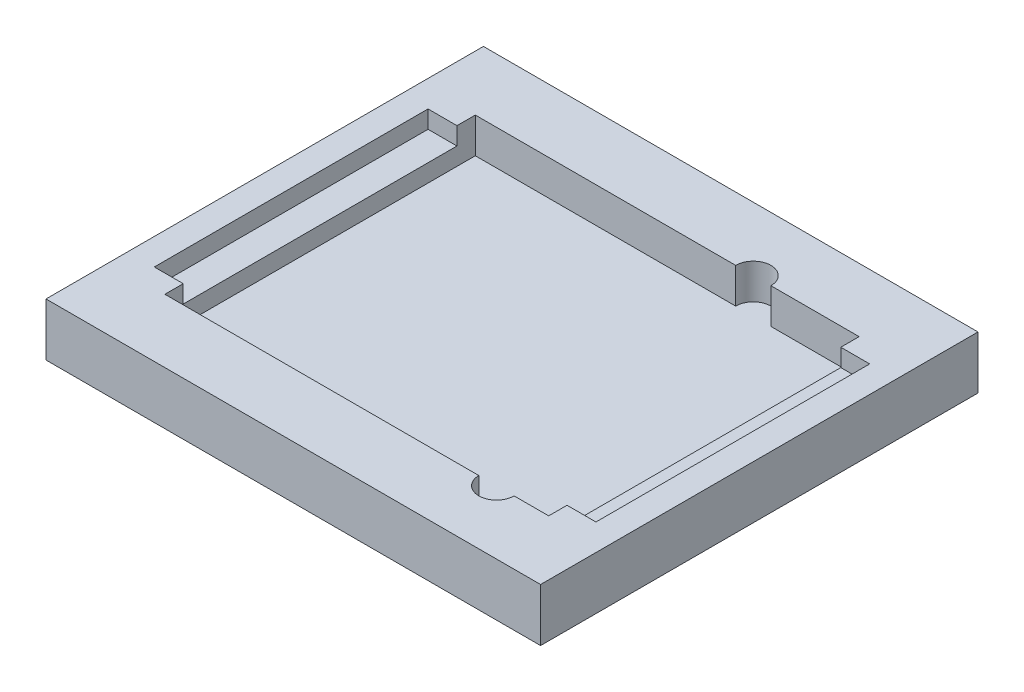
ISO-10303-21;
HEADER;
FILE_DESCRIPTION(('STEP AP214'),'2;1');
FILE_NAME('part.step','',(''),(''),'','','');
FILE_SCHEMA(('AUTOMOTIVE_DESIGN { 1 0 10303 214 1 1 1 1 }'));
ENDSEC;
DATA;
#1=APPLICATION_CONTEXT('core data for automotive mechanical design processes');
#2=APPLICATION_PROTOCOL_DEFINITION('international standard','automotive_design',2000,#1);
#3=PRODUCT_CONTEXT('',#1,'mechanical');
#4=PRODUCT('Part','Part','',(#3));
#5=PRODUCT_RELATED_PRODUCT_CATEGORY('part','',(#4));
#6=PRODUCT_DEFINITION_FORMATION('','',#4);
#7=PRODUCT_DEFINITION_CONTEXT('part definition',#1,'design');
#8=PRODUCT_DEFINITION('design','',#6,#7);
#9=PRODUCT_DEFINITION_SHAPE('','',#8);
#10=(LENGTH_UNIT() NAMED_UNIT(*) SI_UNIT(.MILLI.,.METRE.));
#11=(NAMED_UNIT(*) PLANE_ANGLE_UNIT() SI_UNIT($,.RADIAN.));
#12=(NAMED_UNIT(*) SI_UNIT($,.STERADIAN.) SOLID_ANGLE_UNIT());
#13=UNCERTAINTY_MEASURE_WITH_UNIT(LENGTH_MEASURE(1.E-05),#10,'distance_accuracy_value','');
#14=(GEOMETRIC_REPRESENTATION_CONTEXT(3) GLOBAL_UNCERTAINTY_ASSIGNED_CONTEXT((#13)) GLOBAL_UNIT_ASSIGNED_CONTEXT((#10,
#11,#12)) REPRESENTATION_CONTEXT('',''));
#15=CARTESIAN_POINT('',(0.,0.,0.));
#16=DIRECTION('',(0.,0.,1.));
#17=DIRECTION('',(1.,0.,0.));
#18=AXIS2_PLACEMENT_3D('',#15,#16,#17);
#19=CARTESIAN_POINT('',(2.54,3.175,-2.54));
#20=DIRECTION('',(0.,-1.,0.));
#21=DIRECTION('',(0.,0.,-1.));
#22=AXIS2_PLACEMENT_3D('',#19,#20,#21);
#23=CYLINDRICAL_SURFACE('',#22,2.54);
#24=CARTESIAN_POINT('',(2.54,0.,-2.54));
#25=DIRECTION('',(0.,1.,0.));
#26=DIRECTION('',(0.,0.,-1.));
#27=AXIS2_PLACEMENT_3D('',#24,#25,#26);
#28=CIRCLE('',#27,2.54);
#29=CARTESIAN_POINT('',(0.,0.,-2.54000000000002));
#30=VERTEX_POINT('',#29);
#31=CARTESIAN_POINT('',(2.54000000000002,0.,0.));
#32=VERTEX_POINT('',#31);
#33=EDGE_CURVE('E381',#30,#32,#28,.T.);
#34=ORIENTED_EDGE('',*,*,#33,.T.);
#35=DIRECTION('',(0.,-1.,0.));
#36=VECTOR('',#35,1.);
#37=CARTESIAN_POINT('',(2.54000000000002,3.175,0.));
#38=LINE('',#37,#36);
#39=CARTESIAN_POINT('',(2.54000000000002,3.175,0.));
#40=VERTEX_POINT('',#39);
#41=EDGE_CURVE('E11',#40,#32,#38,.T.);
#42=ORIENTED_EDGE('',*,*,#41,.F.);
#43=CARTESIAN_POINT('',(2.54,3.175,-2.54));
#44=DIRECTION('',(0.,1.,0.));
#45=DIRECTION('',(0.,0.,-1.));
#46=AXIS2_PLACEMENT_3D('',#43,#44,#45);
#47=CIRCLE('',#46,2.54);
#48=CARTESIAN_POINT('',(0.,3.175,-2.54000000000002));
#49=VERTEX_POINT('',#48);
#50=EDGE_CURVE('E382',#49,#40,#47,.T.);
#51=ORIENTED_EDGE('',*,*,#50,.F.);
#52=DIRECTION('',(0.,-1.,0.));
#53=VECTOR('',#52,1.);
#54=CARTESIAN_POINT('',(0.,3.175,-2.54000000000002));
#55=LINE('',#54,#53);
#56=EDGE_CURVE('E407',#49,#30,#55,.T.);
#57=ORIENTED_EDGE('',*,*,#56,.T.);
#58=EDGE_LOOP('',(#34,#42,#51,#57));
#59=FACE_BOUND('',#58,.T.);
#60=ADVANCED_FACE('F35',(#59),#23,.T.);
#61=CARTESIAN_POINT('',(2.54000000000002,3.175,0.));
#62=DIRECTION('',(0.,0.,-1.));
#63=DIRECTION('',(-1.,0.,0.));
#64=AXIS2_PLACEMENT_3D('',#61,#62,#63);
#65=PLANE('',#64);
#66=DIRECTION('',(1.,0.,0.));
#67=VECTOR('',#66,1.);
#68=CARTESIAN_POINT('',(2.54000000000002,0.,0.));
#69=LINE('',#68,#67);
#70=CARTESIAN_POINT('',(80.01,0.,0.));
#71=VERTEX_POINT('',#70);
#72=EDGE_CURVE('E410',#32,#71,#69,.T.);
#73=ORIENTED_EDGE('',*,*,#72,.T.);
#74=DIRECTION('',(0.,-1.,0.));
#75=VECTOR('',#74,1.);
#76=CARTESIAN_POINT('',(80.01,3.175,0.));
#77=LINE('',#76,#75);
#78=CARTESIAN_POINT('',(80.01,3.175,0.));
#79=VERTEX_POINT('',#78);
#80=EDGE_CURVE('E42',#79,#71,#77,.T.);
#81=ORIENTED_EDGE('',*,*,#80,.F.);
#82=DIRECTION('',(1.,0.,0.));
#83=VECTOR('',#82,1.);
#84=CARTESIAN_POINT('',(2.54000000000002,3.175,0.));
#85=LINE('',#84,#83);
#86=EDGE_CURVE('E385',#40,#79,#85,.T.);
#87=ORIENTED_EDGE('',*,*,#86,.F.);
#88=ORIENTED_EDGE('',*,*,#41,.T.);
#89=EDGE_LOOP('',(#73,#81,#87,#88));
#90=FACE_BOUND('',#89,.T.);
#91=ADVANCED_FACE('F461',(#90),#65,.F.);
#92=CARTESIAN_POINT('',(80.01,3.175,-2.54));
#93=DIRECTION('',(0.,-1.,0.));
#94=DIRECTION('',(0.,0.,-1.));
#95=AXIS2_PLACEMENT_3D('',#92,#93,#94);
#96=CYLINDRICAL_SURFACE('',#95,2.54);
#97=CARTESIAN_POINT('',(80.01,0.,-2.54));
#98=DIRECTION('',(0.,1.,0.));
#99=DIRECTION('',(0.,0.,1.));
#100=AXIS2_PLACEMENT_3D('',#97,#98,#99);
#101=CIRCLE('',#100,2.54);
#102=CARTESIAN_POINT('',(82.55,0.,-2.54000000000002));
#103=VERTEX_POINT('',#102);
#104=EDGE_CURVE('E412',#71,#103,#101,.T.);
#105=ORIENTED_EDGE('',*,*,#104,.T.);
#106=DIRECTION('',(0.,-1.,0.));
#107=VECTOR('',#106,1.);
#108=CARTESIAN_POINT('',(82.55,3.175,-2.54000000000002));
#109=LINE('',#108,#107);
#110=CARTESIAN_POINT('',(82.55,3.175,-2.54000000000002));
#111=VERTEX_POINT('',#110);
#112=EDGE_CURVE('E437',#111,#103,#109,.T.);
#113=ORIENTED_EDGE('',*,*,#112,.F.);
#114=CARTESIAN_POINT('',(80.01,3.175,-2.54));
#115=DIRECTION('',(0.,1.,0.));
#116=DIRECTION('',(0.,0.,1.));
#117=AXIS2_PLACEMENT_3D('',#114,#115,#116);
#118=CIRCLE('',#117,2.54);
#119=EDGE_CURVE('E389',#79,#111,#118,.T.);
#120=ORIENTED_EDGE('',*,*,#119,.F.);
#121=ORIENTED_EDGE('',*,*,#80,.T.);
#122=EDGE_LOOP('',(#105,#113,#120,#121));
#123=FACE_BOUND('',#122,.T.);
#124=ADVANCED_FACE('F443',(#123),#96,.T.);
#125=CARTESIAN_POINT('',(82.55,3.175,-2.54000000000002));
#126=DIRECTION('',(-1.,0.,0.));
#127=DIRECTION('',(0.,0.,1.));
#128=AXIS2_PLACEMENT_3D('',#125,#126,#127);
#129=PLANE('',#128);
#130=DIRECTION('',(0.,0.,-1.));
#131=VECTOR('',#130,1.);
#132=CARTESIAN_POINT('',(82.55,0.,-2.54000000000002));
#133=LINE('',#132,#131);
#134=CARTESIAN_POINT('',(82.55,0.,-69.596));
#135=VERTEX_POINT('',#134);
#136=EDGE_CURVE('E414',#103,#135,#133,.T.);
#137=ORIENTED_EDGE('',*,*,#136,.T.);
#138=DIRECTION('',(0.,-1.,0.));
#139=VECTOR('',#138,1.);
#140=CARTESIAN_POINT('',(82.55,3.175,-69.596));
#141=LINE('',#140,#139);
#142=CARTESIAN_POINT('',(82.55,3.175,-69.596));
#143=VERTEX_POINT('',#142);
#144=EDGE_CURVE('E434',#143,#135,#141,.T.);
#145=ORIENTED_EDGE('',*,*,#144,.F.);
#146=DIRECTION('',(0.,0.,-1.));
#147=VECTOR('',#146,1.);
#148=CARTESIAN_POINT('',(82.55,3.175,-2.54000000000002));
#149=LINE('',#148,#147);
#150=EDGE_CURVE('E392',#111,#143,#149,.T.);
#151=ORIENTED_EDGE('',*,*,#150,.F.);
#152=ORIENTED_EDGE('',*,*,#112,.T.);
#153=EDGE_LOOP('',(#137,#145,#151,#152));
#154=FACE_BOUND('',#153,.T.);
#155=ADVANCED_FACE('F452',(#154),#129,.F.);
#156=CARTESIAN_POINT('',(80.01,3.175,-69.596));
#157=DIRECTION('',(0.,-1.,0.));
#158=DIRECTION('',(0.,0.,-1.));
#159=AXIS2_PLACEMENT_3D('',#156,#157,#158);
#160=CYLINDRICAL_SURFACE('',#159,2.54);
#161=CARTESIAN_POINT('',(80.01,0.,-69.596));
#162=DIRECTION('',(0.,1.,0.));
#163=DIRECTION('',(0.,0.,-1.));
#164=AXIS2_PLACEMENT_3D('',#161,#162,#163);
#165=CIRCLE('',#164,2.54);
#166=CARTESIAN_POINT('',(80.01,0.,-72.136));
#167=VERTEX_POINT('',#166);
#168=EDGE_CURVE('E416',#135,#167,#165,.T.);
#169=ORIENTED_EDGE('',*,*,#168,.T.);
#170=DIRECTION('',(0.,-1.,0.));
#171=VECTOR('',#170,1.);
#172=CARTESIAN_POINT('',(80.01,3.175,-72.136));
#173=LINE('',#172,#171);
#174=CARTESIAN_POINT('',(80.01,3.175,-72.136));
#175=VERTEX_POINT('',#174);
#176=EDGE_CURVE('E431',#175,#167,#173,.T.);
#177=ORIENTED_EDGE('',*,*,#176,.F.);
#178=CARTESIAN_POINT('',(80.01,3.175,-69.596));
#179=DIRECTION('',(0.,1.,0.));
#180=DIRECTION('',(0.,0.,-1.));
#181=AXIS2_PLACEMENT_3D('',#178,#179,#180);
#182=CIRCLE('',#181,2.54);
#183=EDGE_CURVE('E395',#143,#175,#182,.T.);
#184=ORIENTED_EDGE('',*,*,#183,.F.);
#185=ORIENTED_EDGE('',*,*,#144,.T.);
#186=EDGE_LOOP('',(#169,#177,#184,#185));
#187=FACE_BOUND('',#186,.T.);
#188=ADVANCED_FACE('F456',(#187),#160,.T.);
#189=CARTESIAN_POINT('',(2.54000000000002,3.175,-72.136));
#190=DIRECTION('',(0.,0.,1.));
#191=DIRECTION('',(1.,0.,0.));
#192=AXIS2_PLACEMENT_3D('',#189,#190,#191);
#193=PLANE('',#192);
#194=DIRECTION('',(-1.,0.,0.));
#195=VECTOR('',#194,1.);
#196=CARTESIAN_POINT('',(2.54000000000002,0.,-72.136));
#197=LINE('',#196,#195);
#198=CARTESIAN_POINT('',(2.54000000000002,0.,-72.136));
#199=VERTEX_POINT('',#198);
#200=EDGE_CURVE('E418',#167,#199,#197,.T.);
#201=ORIENTED_EDGE('',*,*,#200,.T.);
#202=DIRECTION('',(0.,-1.,0.));
#203=VECTOR('',#202,1.);
#204=CARTESIAN_POINT('',(2.54000000000002,3.175,-72.136));
#205=LINE('',#204,#203);
#206=CARTESIAN_POINT('',(2.54000000000002,3.175,-72.136));
#207=VERTEX_POINT('',#206);
#208=EDGE_CURVE('E428',#207,#199,#205,.T.);
#209=ORIENTED_EDGE('',*,*,#208,.F.);
#210=DIRECTION('',(-1.,0.,0.));
#211=VECTOR('',#210,1.);
#212=CARTESIAN_POINT('',(2.54000000000002,3.175,-72.136));
#213=LINE('',#212,#211);
#214=EDGE_CURVE('E398',#175,#207,#213,.T.);
#215=ORIENTED_EDGE('',*,*,#214,.F.);
#216=ORIENTED_EDGE('',*,*,#176,.T.);
#217=EDGE_LOOP('',(#201,#209,#215,#216));
#218=FACE_BOUND('',#217,.T.);
#219=ADVANCED_FACE('F473',(#218),#193,.F.);
#220=CARTESIAN_POINT('',(2.54,3.175,-69.596));
#221=DIRECTION('',(0.,-1.,0.));
#222=DIRECTION('',(0.,0.,-1.));
#223=AXIS2_PLACEMENT_3D('',#220,#221,#222);
#224=CYLINDRICAL_SURFACE('',#223,2.54);
#225=CARTESIAN_POINT('',(2.54,0.,-69.596));
#226=DIRECTION('',(0.,1.,0.));
#227=DIRECTION('',(0.,0.,1.));
#228=AXIS2_PLACEMENT_3D('',#225,#226,#227);
#229=CIRCLE('',#228,2.54);
#230=CARTESIAN_POINT('',(0.,0.,-69.596));
#231=VERTEX_POINT('',#230);
#232=EDGE_CURVE('E420',#199,#231,#229,.T.);
#233=ORIENTED_EDGE('',*,*,#232,.T.);
#234=DIRECTION('',(0.,-1.,0.));
#235=VECTOR('',#234,1.);
#236=CARTESIAN_POINT('',(0.,3.175,-69.596));
#237=LINE('',#236,#235);
#238=CARTESIAN_POINT('',(0.,3.175,-69.596));
#239=VERTEX_POINT('',#238);
#240=EDGE_CURVE('E425',#239,#231,#237,.T.);
#241=ORIENTED_EDGE('',*,*,#240,.F.);
#242=CARTESIAN_POINT('',(2.54,3.175,-69.596));
#243=DIRECTION('',(0.,1.,0.));
#244=DIRECTION('',(0.,0.,1.));
#245=AXIS2_PLACEMENT_3D('',#242,#243,#244);
#246=CIRCLE('',#245,2.54);
#247=EDGE_CURVE('E401',#207,#239,#246,.T.);
#248=ORIENTED_EDGE('',*,*,#247,.F.);
#249=ORIENTED_EDGE('',*,*,#208,.T.);
#250=EDGE_LOOP('',(#233,#241,#248,#249));
#251=FACE_BOUND('',#250,.T.);
#252=ADVANCED_FACE('F471',(#251),#224,.T.);
#253=CARTESIAN_POINT('',(0.,3.175,-2.54000000000002));
#254=DIRECTION('',(1.,0.,0.));
#255=DIRECTION('',(0.,0.,-1.));
#256=AXIS2_PLACEMENT_3D('',#253,#254,#255);
#257=PLANE('',#256);
#258=DIRECTION('',(0.,0.,1.));
#259=VECTOR('',#258,1.);
#260=CARTESIAN_POINT('',(0.,0.,-2.54000000000002));
#261=LINE('',#260,#259);
#262=EDGE_CURVE('E386',#231,#30,#261,.T.);
#263=ORIENTED_EDGE('',*,*,#262,.T.);
#264=ORIENTED_EDGE('',*,*,#56,.F.);
#265=DIRECTION('',(0.,0.,1.));
#266=VECTOR('',#265,1.);
#267=CARTESIAN_POINT('',(0.,3.175,-2.54000000000002));
#268=LINE('',#267,#266);
#269=EDGE_CURVE('E404',#239,#49,#268,.T.);
#270=ORIENTED_EDGE('',*,*,#269,.F.);
#271=ORIENTED_EDGE('',*,*,#240,.T.);
#272=EDGE_LOOP('',(#263,#264,#270,#271));
#273=FACE_BOUND('',#272,.T.);
#274=ADVANCED_FACE('F467',(#273),#257,.F.);
#275=CARTESIAN_POINT('',(2.54,0.,-2.54));
#276=DIRECTION('',(0.,-1.,0.));
#277=DIRECTION('',(0.,0.,-1.));
#278=AXIS2_PLACEMENT_3D('',#275,#276,#277);
#279=PLANE('',#278);
#280=ORIENTED_EDGE('',*,*,#33,.F.);
#281=ORIENTED_EDGE('',*,*,#262,.F.);
#282=ORIENTED_EDGE('',*,*,#232,.F.);
#283=ORIENTED_EDGE('',*,*,#200,.F.);
#284=ORIENTED_EDGE('',*,*,#168,.F.);
#285=ORIENTED_EDGE('',*,*,#136,.F.);
#286=ORIENTED_EDGE('',*,*,#104,.F.);
#287=ORIENTED_EDGE('',*,*,#72,.F.);
#288=EDGE_LOOP('',(#280,#281,#282,#283,#284,#285,#286,#287));
#289=FACE_BOUND('',#288,.T.);
#290=ADVANCED_FACE('F448',(#289),#279,.T.);
#291=CARTESIAN_POINT('',(0.,3.175,0.));
#292=DIRECTION('',(0.,1.,0.));
#293=DIRECTION('',(0.,0.,1.));
#294=AXIS2_PLACEMENT_3D('',#291,#292,#293);
#295=PLANE('',#294);
#296=DIRECTION('',(-1.,0.,0.));
#297=VECTOR('',#296,1.);
#298=CARTESIAN_POINT('',(85.7885,3.175,-75.438));
#299=LINE('',#298,#297);
#300=CARTESIAN_POINT('',(85.7885,3.175,-75.438));
#301=VERTEX_POINT('',#300);
#302=CARTESIAN_POINT('',(-3.2385,3.175,-75.438));
#303=VERTEX_POINT('',#302);
#304=EDGE_CURVE('E368',#301,#303,#299,.T.);
#305=ORIENTED_EDGE('',*,*,#304,.F.);
#306=DIRECTION('',(0.,0.,1.));
#307=VECTOR('',#306,1.);
#308=CARTESIAN_POINT('',(85.7885,3.175,-75.438));
#309=LINE('',#308,#307);
#310=CARTESIAN_POINT('',(85.7885,3.175,3.30200000000003));
#311=VERTEX_POINT('',#310);
#312=EDGE_CURVE('E224',#301,#311,#309,.T.);
#313=ORIENTED_EDGE('',*,*,#312,.T.);
#314=DIRECTION('',(-1.,0.,0.));
#315=VECTOR('',#314,1.);
#316=CARTESIAN_POINT('',(85.7885,3.175,3.30200000000003));
#317=LINE('',#316,#315);
#318=CARTESIAN_POINT('',(-3.2385,3.175,3.30200000000001));
#319=VERTEX_POINT('',#318);
#320=EDGE_CURVE('E373',#311,#319,#317,.T.);
#321=ORIENTED_EDGE('',*,*,#320,.T.);
#322=DIRECTION('',(0.,0.,1.));
#323=VECTOR('',#322,1.);
#324=CARTESIAN_POINT('',(-3.2385,3.175,-75.438));
#325=LINE('',#324,#323);
#326=EDGE_CURVE('E370',#303,#319,#325,.T.);
#327=ORIENTED_EDGE('',*,*,#326,.F.);
#328=EDGE_LOOP('',(#305,#313,#321,#327));
#329=FACE_BOUND('',#328,.T.);
#330=ORIENTED_EDGE('',*,*,#269,.T.);
#331=ORIENTED_EDGE('',*,*,#50,.T.);
#332=ORIENTED_EDGE('',*,*,#86,.T.);
#333=ORIENTED_EDGE('',*,*,#119,.T.);
#334=ORIENTED_EDGE('',*,*,#150,.T.);
#335=ORIENTED_EDGE('',*,*,#183,.T.);
#336=ORIENTED_EDGE('',*,*,#214,.T.);
#337=ORIENTED_EDGE('',*,*,#247,.T.);
#338=EDGE_LOOP('',(#330,#331,#332,#333,#334,#335,#336,#337));
#339=FACE_BOUND('',#338,.T.);
#340=ADVANCED_FACE('F459',(#329,#339),#295,.F.);
#341=CARTESIAN_POINT('',(85.7885,9.525,-75.438));
#342=DIRECTION('',(0.,0.,1.));
#343=DIRECTION('',(1.,0.,0.));
#344=AXIS2_PLACEMENT_3D('',#341,#342,#343);
#345=PLANE('',#344);
#346=ORIENTED_EDGE('',*,*,#304,.T.);
#347=DIRECTION('',(0.,-1.,0.));
#348=VECTOR('',#347,1.);
#349=CARTESIAN_POINT('',(-3.2385,9.525,-75.438));
#350=LINE('',#349,#348);
#351=CARTESIAN_POINT('',(-3.2385,12.7,-75.438));
#352=VERTEX_POINT('',#351);
#353=EDGE_CURVE('E234',#352,#303,#350,.T.);
#354=ORIENTED_EDGE('',*,*,#353,.F.);
#355=DIRECTION('',(-1.,0.,0.));
#356=VECTOR('',#355,1.);
#357=CARTESIAN_POINT('',(0.,12.7,-75.438));
#358=LINE('',#357,#356);
#359=CARTESIAN_POINT('',(85.7885,12.7,-75.438));
#360=VERTEX_POINT('',#359);
#361=EDGE_CURVE('E231',#360,#352,#358,.T.);
#362=ORIENTED_EDGE('',*,*,#361,.F.);
#363=DIRECTION('',(0.,-1.,0.));
#364=VECTOR('',#363,1.);
#365=CARTESIAN_POINT('',(85.7885,9.525,-75.438));
#366=LINE('',#365,#364);
#367=EDGE_CURVE('E218',#360,#301,#366,.T.);
#368=ORIENTED_EDGE('',*,*,#367,.T.);
#369=EDGE_LOOP('',(#346,#354,#362,#368));
#370=FACE_BOUND('',#369,.T.);
#371=ADVANCED_FACE('F232',(#370),#345,.F.);
#372=CARTESIAN_POINT('',(-3.2385,9.525,-75.438));
#373=DIRECTION('',(1.,0.,0.));
#374=DIRECTION('',(0.,0.,-1.));
#375=AXIS2_PLACEMENT_3D('',#372,#373,#374);
#376=PLANE('',#375);
#377=ORIENTED_EDGE('',*,*,#326,.T.);
#378=DIRECTION('',(0.,-1.,0.));
#379=VECTOR('',#378,1.);
#380=CARTESIAN_POINT('',(-3.2385,9.525,3.30200000000001));
#381=LINE('',#380,#379);
#382=CARTESIAN_POINT('',(-3.23850000000001,12.7,3.30200000000001));
#383=VERTEX_POINT('',#382);
#384=EDGE_CURVE('E378',#383,#319,#381,.T.);
#385=ORIENTED_EDGE('',*,*,#384,.F.);
#386=DIRECTION('',(0.,0.,1.));
#387=VECTOR('',#386,1.);
#388=CARTESIAN_POINT('',(-3.2385,12.7,0.));
#389=LINE('',#388,#387);
#390=EDGE_CURVE('E238',#352,#383,#389,.T.);
#391=ORIENTED_EDGE('',*,*,#390,.F.);
#392=ORIENTED_EDGE('',*,*,#353,.T.);
#393=EDGE_LOOP('',(#377,#385,#391,#392));
#394=FACE_BOUND('',#393,.T.);
#395=ADVANCED_FACE('F554',(#394),#376,.F.);
#396=CARTESIAN_POINT('',(85.7885,9.525,3.30200000000003));
#397=DIRECTION('',(0.,0.,1.));
#398=DIRECTION('',(1.,0.,0.));
#399=AXIS2_PLACEMENT_3D('',#396,#397,#398);
#400=PLANE('',#399);
#401=ORIENTED_EDGE('',*,*,#320,.F.);
#402=DIRECTION('',(0.,-1.,0.));
#403=VECTOR('',#402,1.);
#404=CARTESIAN_POINT('',(85.7885,9.525,3.30200000000003));
#405=LINE('',#404,#403);
#406=CARTESIAN_POINT('',(85.7885,12.7,3.30200000000003));
#407=VERTEX_POINT('',#406);
#408=EDGE_CURVE('E228',#407,#311,#405,.T.);
#409=ORIENTED_EDGE('',*,*,#408,.F.);
#410=DIRECTION('',(1.,0.,0.));
#411=VECTOR('',#410,1.);
#412=CARTESIAN_POINT('',(0.,12.7,3.30200000000001));
#413=LINE('',#412,#411);
#414=EDGE_CURVE('E244',#383,#407,#413,.T.);
#415=ORIENTED_EDGE('',*,*,#414,.F.);
#416=ORIENTED_EDGE('',*,*,#384,.T.);
#417=EDGE_LOOP('',(#401,#409,#415,#416));
#418=FACE_BOUND('',#417,.T.);
#419=ADVANCED_FACE('F565',(#418),#400,.T.);
#420=CARTESIAN_POINT('',(85.7885,9.525,-75.438));
#421=DIRECTION('',(1.,0.,0.));
#422=DIRECTION('',(0.,0.,-1.));
#423=AXIS2_PLACEMENT_3D('',#420,#421,#422);
#424=PLANE('',#423);
#425=ORIENTED_EDGE('',*,*,#312,.F.);
#426=ORIENTED_EDGE('',*,*,#367,.F.);
#427=DIRECTION('',(0.,0.,-1.));
#428=VECTOR('',#427,1.);
#429=CARTESIAN_POINT('',(85.7885,12.7,0.));
#430=LINE('',#429,#428);
#431=EDGE_CURVE('E222',#407,#360,#430,.T.);
#432=ORIENTED_EDGE('',*,*,#431,.F.);
#433=ORIENTED_EDGE('',*,*,#408,.T.);
#434=EDGE_LOOP('',(#425,#426,#432,#433));
#435=FACE_BOUND('',#434,.T.);
#436=ADVANCED_FACE('F220',(#435),#424,.T.);
#437=CARTESIAN_POINT('',(81.026,12.7,0.));
#438=DIRECTION('',(-1.,0.,0.));
#439=DIRECTION('',(0.,0.,1.));
#440=AXIS2_PLACEMENT_3D('',#437,#438,#439);
#441=PLANE('',#440);
#442=DIRECTION('',(0.,0.,-1.));
#443=VECTOR('',#442,1.);
#444=CARTESIAN_POINT('',(81.026,9.525,0.));
#445=LINE('',#444,#443);
#446=CARTESIAN_POINT('',(81.026,9.525,-11.43));
#447=VERTEX_POINT('',#446);
#448=CARTESIAN_POINT('',(81.026,9.525,-60.706));
#449=VERTEX_POINT('',#448);
#450=EDGE_CURVE('E295',#447,#449,#445,.T.);
#451=ORIENTED_EDGE('',*,*,#450,.F.);
#452=DIRECTION('',(0.,-1.,0.));
#453=VECTOR('',#452,1.);
#454=CARTESIAN_POINT('',(81.026,12.7,-11.43));
#455=LINE('',#454,#453);
#456=CARTESIAN_POINT('',(81.026,12.7,-11.43));
#457=VERTEX_POINT('',#456);
#458=EDGE_CURVE('E322',#457,#447,#455,.T.);
#459=ORIENTED_EDGE('',*,*,#458,.F.);
#460=DIRECTION('',(0.,0.,-1.));
#461=VECTOR('',#460,1.);
#462=CARTESIAN_POINT('',(81.026,12.7,0.));
#463=LINE('',#462,#461);
#464=CARTESIAN_POINT('',(81.026,12.7,-60.706));
#465=VERTEX_POINT('',#464);
#466=EDGE_CURVE('E251',#457,#465,#463,.T.);
#467=ORIENTED_EDGE('',*,*,#466,.T.);
#468=DIRECTION('',(0.,-1.,0.));
#469=VECTOR('',#468,1.);
#470=CARTESIAN_POINT('',(81.026,12.7,-60.706));
#471=LINE('',#470,#469);
#472=EDGE_CURVE('E294',#465,#449,#471,.T.);
#473=ORIENTED_EDGE('',*,*,#472,.T.);
#474=EDGE_LOOP('',(#451,#459,#467,#473));
#475=FACE_BOUND('',#474,.T.);
#476=ADVANCED_FACE('F586',(#475),#441,.T.);
#477=CARTESIAN_POINT('',(0.,12.7,-11.43));
#478=DIRECTION('',(0.,0.,1.));
#479=DIRECTION('',(1.,0.,0.));
#480=AXIS2_PLACEMENT_3D('',#477,#478,#479);
#481=PLANE('',#480);
#482=DIRECTION('',(-1.,0.,0.));
#483=VECTOR('',#482,1.);
#484=CARTESIAN_POINT('',(0.,9.525,-11.43));
#485=LINE('',#484,#483);
#486=CARTESIAN_POINT('',(75.819,9.525,-11.43));
#487=VERTEX_POINT('',#486);
#488=EDGE_CURVE('E297',#447,#487,#485,.T.);
#489=ORIENTED_EDGE('',*,*,#488,.T.);
#490=DIRECTION('',(0.,-1.,0.));
#491=VECTOR('',#490,1.);
#492=CARTESIAN_POINT('',(75.819,12.7,-11.43));
#493=LINE('',#492,#491);
#494=CARTESIAN_POINT('',(75.819,12.7,-11.43));
#495=VERTEX_POINT('',#494);
#496=EDGE_CURVE('E319',#495,#487,#493,.T.);
#497=ORIENTED_EDGE('',*,*,#496,.F.);
#498=DIRECTION('',(-1.,0.,0.));
#499=VECTOR('',#498,1.);
#500=CARTESIAN_POINT('',(0.,12.7,-11.43));
#501=LINE('',#500,#499);
#502=EDGE_CURVE('E254',#457,#495,#501,.T.);
#503=ORIENTED_EDGE('',*,*,#502,.F.);
#504=ORIENTED_EDGE('',*,*,#458,.T.);
#505=EDGE_LOOP('',(#489,#497,#503,#504));
#506=FACE_BOUND('',#505,.T.);
#507=ADVANCED_FACE('F596',(#506),#481,.F.);
#508=CARTESIAN_POINT('',(0.,12.7,-11.43));
#509=DIRECTION('',(0.,0.,-1.));
#510=DIRECTION('',(-1.,0.,0.));
#511=AXIS2_PLACEMENT_3D('',#508,#509,#510);
#512=PLANE('',#511);
#513=DIRECTION('',(1.,0.,0.));
#514=VECTOR('',#513,1.);
#515=CARTESIAN_POINT('',(0.,9.525,-11.43));
#516=LINE('',#515,#514);
#517=CARTESIAN_POINT('',(1.524,9.525,-11.43));
#518=VERTEX_POINT('',#517);
#519=CARTESIAN_POINT('',(6.73100000000001,9.525,-11.43));
#520=VERTEX_POINT('',#519);
#521=EDGE_CURVE('E300',#518,#520,#516,.T.);
#522=ORIENTED_EDGE('',*,*,#521,.F.);
#523=DIRECTION('',(0.,-1.,0.));
#524=VECTOR('',#523,1.);
#525=CARTESIAN_POINT('',(1.524,12.7,-11.43));
#526=LINE('',#525,#524);
#527=CARTESIAN_POINT('',(1.524,12.7,-11.43));
#528=VERTEX_POINT('',#527);
#529=EDGE_CURVE('E314',#528,#518,#526,.T.);
#530=ORIENTED_EDGE('',*,*,#529,.F.);
#531=DIRECTION('',(1.,0.,0.));
#532=VECTOR('',#531,1.);
#533=CARTESIAN_POINT('',(0.,12.7,-11.43));
#534=LINE('',#533,#532);
#535=CARTESIAN_POINT('',(6.73100000000001,12.7,-11.43));
#536=VERTEX_POINT('',#535);
#537=EDGE_CURVE('E272',#528,#536,#534,.T.);
#538=ORIENTED_EDGE('',*,*,#537,.T.);
#539=DIRECTION('',(0.,-1.,0.));
#540=VECTOR('',#539,1.);
#541=CARTESIAN_POINT('',(6.73100000000001,12.7,-11.43));
#542=LINE('',#541,#540);
#543=EDGE_CURVE('E316',#536,#520,#542,.T.);
#544=ORIENTED_EDGE('',*,*,#543,.T.);
#545=EDGE_LOOP('',(#522,#530,#538,#544));
#546=FACE_BOUND('',#545,.T.);
#547=ADVANCED_FACE('F607',(#546),#512,.T.);
#548=CARTESIAN_POINT('',(1.524,12.7,0.));
#549=DIRECTION('',(-1.,0.,0.));
#550=DIRECTION('',(0.,0.,1.));
#551=AXIS2_PLACEMENT_3D('',#548,#549,#550);
#552=PLANE('',#551);
#553=DIRECTION('',(0.,0.,-1.));
#554=VECTOR('',#553,1.);
#555=CARTESIAN_POINT('',(1.524,9.525,0.));
#556=LINE('',#555,#554);
#557=CARTESIAN_POINT('',(1.524,9.525,-60.706));
#558=VERTEX_POINT('',#557);
#559=EDGE_CURVE('E54',#518,#558,#556,.T.);
#560=ORIENTED_EDGE('',*,*,#559,.T.);
#561=DIRECTION('',(0.,-1.,0.));
#562=VECTOR('',#561,1.);
#563=CARTESIAN_POINT('',(1.524,12.7,-60.706));
#564=LINE('',#563,#562);
#565=CARTESIAN_POINT('',(1.524,12.7,-60.706));
#566=VERTEX_POINT('',#565);
#567=EDGE_CURVE('E312',#566,#558,#564,.T.);
#568=ORIENTED_EDGE('',*,*,#567,.F.);
#569=DIRECTION('',(0.,0.,-1.));
#570=VECTOR('',#569,1.);
#571=CARTESIAN_POINT('',(1.524,12.7,0.));
#572=LINE('',#571,#570);
#573=EDGE_CURVE('E276',#528,#566,#572,.T.);
#574=ORIENTED_EDGE('',*,*,#573,.F.);
#575=ORIENTED_EDGE('',*,*,#529,.T.);
#576=EDGE_LOOP('',(#560,#568,#574,#575));
#577=FACE_BOUND('',#576,.T.);
#578=ADVANCED_FACE('F618',(#577),#552,.F.);
#579=CARTESIAN_POINT('',(0.,12.7,-60.706));
#580=DIRECTION('',(0.,0.,-1.));
#581=DIRECTION('',(-1.,0.,0.));
#582=AXIS2_PLACEMENT_3D('',#579,#580,#581);
#583=PLANE('',#582);
#584=DIRECTION('',(1.,0.,0.));
#585=VECTOR('',#584,1.);
#586=CARTESIAN_POINT('',(0.,9.525,-60.706));
#587=LINE('',#586,#585);
#588=CARTESIAN_POINT('',(6.73100000000001,9.525,-60.706));
#589=VERTEX_POINT('',#588);
#590=EDGE_CURVE('E49',#558,#589,#587,.T.);
#591=ORIENTED_EDGE('',*,*,#590,.T.);
#592=DIRECTION('',(0.,-1.,0.));
#593=VECTOR('',#592,1.);
#594=CARTESIAN_POINT('',(6.73100000000001,12.7,-60.706));
#595=LINE('',#594,#593);
#596=CARTESIAN_POINT('',(6.73100000000001,12.7,-60.706));
#597=VERTEX_POINT('',#596);
#598=EDGE_CURVE('E309',#597,#589,#595,.T.);
#599=ORIENTED_EDGE('',*,*,#598,.F.);
#600=DIRECTION('',(1.,0.,0.));
#601=VECTOR('',#600,1.);
#602=CARTESIAN_POINT('',(0.,12.7,-60.706));
#603=LINE('',#602,#601);
#604=EDGE_CURVE('E279',#566,#597,#603,.T.);
#605=ORIENTED_EDGE('',*,*,#604,.F.);
#606=ORIENTED_EDGE('',*,*,#567,.T.);
#607=EDGE_LOOP('',(#591,#599,#605,#606));
#608=FACE_BOUND('',#607,.T.);
#609=ADVANCED_FACE('F629',(#608),#583,.F.);
#610=CARTESIAN_POINT('',(0.,12.7,-60.706));
#611=DIRECTION('',(0.,0.,1.));
#612=DIRECTION('',(1.,0.,0.));
#613=AXIS2_PLACEMENT_3D('',#610,#611,#612);
#614=PLANE('',#613);
#615=DIRECTION('',(-1.,0.,0.));
#616=VECTOR('',#615,1.);
#617=CARTESIAN_POINT('',(0.,9.525,-60.706));
#618=LINE('',#617,#616);
#619=CARTESIAN_POINT('',(75.819,9.525,-60.706));
#620=VERTEX_POINT('',#619);
#621=EDGE_CURVE('E245',#449,#620,#618,.T.);
#622=ORIENTED_EDGE('',*,*,#621,.F.);
#623=ORIENTED_EDGE('',*,*,#472,.F.);
#624=DIRECTION('',(-1.,0.,0.));
#625=VECTOR('',#624,1.);
#626=CARTESIAN_POINT('',(0.,12.7,-60.706));
#627=LINE('',#626,#625);
#628=CARTESIAN_POINT('',(75.819,12.7,-60.706));
#629=VERTEX_POINT('',#628);
#630=EDGE_CURVE('E291',#465,#629,#627,.T.);
#631=ORIENTED_EDGE('',*,*,#630,.T.);
#632=DIRECTION('',(0.,-1.,0.));
#633=VECTOR('',#632,1.);
#634=CARTESIAN_POINT('',(75.819,12.7,-60.706));
#635=LINE('',#634,#633);
#636=EDGE_CURVE('E306',#629,#620,#635,.T.);
#637=ORIENTED_EDGE('',*,*,#636,.T.);
#638=EDGE_LOOP('',(#622,#623,#631,#637));
#639=FACE_BOUND('',#638,.T.);
#640=ADVANCED_FACE('F640',(#639),#614,.T.);
#641=CARTESIAN_POINT('',(0.,12.7,0.));
#642=DIRECTION('',(0.,1.,0.));
#643=DIRECTION('',(0.,0.,1.));
#644=AXIS2_PLACEMENT_3D('',#641,#642,#643);
#645=PLANE('',#644);
#646=ORIENTED_EDGE('',*,*,#431,.T.);
#647=ORIENTED_EDGE('',*,*,#361,.T.);
#648=ORIENTED_EDGE('',*,*,#390,.T.);
#649=ORIENTED_EDGE('',*,*,#414,.T.);
#650=EDGE_LOOP('',(#646,#647,#648,#649));
#651=FACE_BOUND('',#650,.T.);
#652=ORIENTED_EDGE('',*,*,#466,.F.);
#653=ORIENTED_EDGE('',*,*,#502,.T.);
#654=DIRECTION('',(0.,0.,1.));
#655=VECTOR('',#654,1.);
#656=CARTESIAN_POINT('',(75.819,12.7,0.));
#657=LINE('',#656,#655);
#658=CARTESIAN_POINT('',(75.819,12.7,-8.12800000000002));
#659=VERTEX_POINT('',#658);
#660=EDGE_CURVE('E257',#495,#659,#657,.T.);
#661=ORIENTED_EDGE('',*,*,#660,.T.);
#662=DIRECTION('',(-1.,0.,0.));
#663=VECTOR('',#662,1.);
#664=CARTESIAN_POINT('',(0.,12.7,-8.12800000000002));
#665=LINE('',#664,#663);
#666=CARTESIAN_POINT('',(69.596,12.7,-8.12800000000002));
#667=VERTEX_POINT('',#666);
#668=EDGE_CURVE('E260',#659,#667,#665,.T.);
#669=ORIENTED_EDGE('',*,*,#668,.T.);
#670=CARTESIAN_POINT('',(66.421,12.7,-8.12800000000002));
#671=DIRECTION('',(0.,1.,0.));
#672=DIRECTION('',(0.,0.,1.));
#673=AXIS2_PLACEMENT_3D('',#670,#671,#672);
#674=CIRCLE('',#673,3.175);
#675=CARTESIAN_POINT('',(63.246,12.7,-8.12800000000002));
#676=VERTEX_POINT('',#675);
#677=EDGE_CURVE('E264',#667,#676,#674,.F.);
#678=ORIENTED_EDGE('',*,*,#677,.T.);
#679=DIRECTION('',(-1.,0.,0.));
#680=VECTOR('',#679,1.);
#681=CARTESIAN_POINT('',(0.,12.7,-8.12800000000002));
#682=LINE('',#681,#680);
#683=CARTESIAN_POINT('',(6.73100000000001,12.7,-8.12800000000002));
#684=VERTEX_POINT('',#683);
#685=EDGE_CURVE('E267',#676,#684,#682,.T.);
#686=ORIENTED_EDGE('',*,*,#685,.T.);
#687=DIRECTION('',(0.,0.,-1.));
#688=VECTOR('',#687,1.);
#689=CARTESIAN_POINT('',(6.73100000000001,12.7,0.));
#690=LINE('',#689,#688);
#691=EDGE_CURVE('E270',#684,#536,#690,.T.);
#692=ORIENTED_EDGE('',*,*,#691,.T.);
#693=ORIENTED_EDGE('',*,*,#537,.F.);
#694=ORIENTED_EDGE('',*,*,#573,.T.);
#695=ORIENTED_EDGE('',*,*,#604,.T.);
#696=CARTESIAN_POINT('',(6.73100000000001,12.7,-64.008));
#697=VERTEX_POINT('',#696);
#698=EDGE_CURVE('E273',#597,#697,#690,.T.);
#699=ORIENTED_EDGE('',*,*,#698,.T.);
#700=DIRECTION('',(1.,0.,0.));
#701=VECTOR('',#700,1.);
#702=CARTESIAN_POINT('',(0.,12.7,-64.008));
#703=LINE('',#702,#701);
#704=CARTESIAN_POINT('',(53.594,12.7,-64.008));
#705=VERTEX_POINT('',#704);
#706=EDGE_CURVE('E282',#697,#705,#703,.T.);
#707=ORIENTED_EDGE('',*,*,#706,.T.);
#708=CARTESIAN_POINT('',(56.769,12.7,-64.008));
#709=DIRECTION('',(0.,1.,0.));
#710=DIRECTION('',(0.,0.,1.));
#711=AXIS2_PLACEMENT_3D('',#708,#709,#710);
#712=CIRCLE('',#711,3.175);
#713=CARTESIAN_POINT('',(59.944,12.7,-64.008));
#714=VERTEX_POINT('',#713);
#715=EDGE_CURVE('E285',#705,#714,#712,.F.);
#716=ORIENTED_EDGE('',*,*,#715,.T.);
#717=DIRECTION('',(1.,0.,0.));
#718=VECTOR('',#717,1.);
#719=CARTESIAN_POINT('',(0.,12.7,-64.008));
#720=LINE('',#719,#718);
#721=CARTESIAN_POINT('',(75.819,12.7,-64.008));
#722=VERTEX_POINT('',#721);
#723=EDGE_CURVE('E288',#714,#722,#720,.T.);
#724=ORIENTED_EDGE('',*,*,#723,.T.);
#725=EDGE_CURVE('E261',#722,#629,#657,.T.);
#726=ORIENTED_EDGE('',*,*,#725,.T.);
#727=ORIENTED_EDGE('',*,*,#630,.F.);
#728=EDGE_LOOP('',(#652,#653,#661,#669,#678,#686,#692,#693,#694,#695,#699,#707,#716,#724,#726,#727));
#729=FACE_BOUND('',#728,.T.);
#730=ADVANCED_FACE('F241',(#651,#729),#645,.T.);
#731=CARTESIAN_POINT('',(56.769,6.35,-64.008));
#732=DIRECTION('',(0.,1.,0.));
#733=DIRECTION('',(0.,0.,1.));
#734=AXIS2_PLACEMENT_3D('',#731,#732,#733);
#735=PLANE('',#734);
#736=DIRECTION('',(0.,0.,-1.));
#737=VECTOR('',#736,1.);
#738=CARTESIAN_POINT('',(6.73100000000001,6.35,-8.12800000000002));
#739=LINE('',#738,#737);
#740=CARTESIAN_POINT('',(6.73100000000001,6.35,-8.12800000000002));
#741=VERTEX_POINT('',#740);
#742=CARTESIAN_POINT('',(6.73100000000001,6.35,-64.008));
#743=VERTEX_POINT('',#742);
#744=EDGE_CURVE('E326',#741,#743,#739,.T.);
#745=ORIENTED_EDGE('',*,*,#744,.F.);
#746=DIRECTION('',(1.,0.,0.));
#747=VECTOR('',#746,1.);
#748=CARTESIAN_POINT('',(6.73100000000001,6.35,-8.12800000000002));
#749=LINE('',#748,#747);
#750=CARTESIAN_POINT('',(63.246,6.35,-8.12800000000002));
#751=VERTEX_POINT('',#750);
#752=EDGE_CURVE('E346',#741,#751,#749,.T.);
#753=ORIENTED_EDGE('',*,*,#752,.T.);
#754=CARTESIAN_POINT('',(66.421,6.35,-8.12800000000002));
#755=DIRECTION('',(0.,1.,0.));
#756=DIRECTION('',(0.,0.,1.));
#757=AXIS2_PLACEMENT_3D('',#754,#755,#756);
#758=CIRCLE('',#757,3.175);
#759=CARTESIAN_POINT('',(69.596,6.35,-8.12800000000002));
#760=VERTEX_POINT('',#759);
#761=EDGE_CURVE('E343',#751,#760,#758,.T.);
#762=ORIENTED_EDGE('',*,*,#761,.T.);
#763=DIRECTION('',(1.,0.,0.));
#764=VECTOR('',#763,1.);
#765=CARTESIAN_POINT('',(69.596,6.35,-8.12800000000002));
#766=LINE('',#765,#764);
#767=CARTESIAN_POINT('',(75.819,6.35,-8.12800000000002));
#768=VERTEX_POINT('',#767);
#769=EDGE_CURVE('E340',#760,#768,#766,.T.);
#770=ORIENTED_EDGE('',*,*,#769,.T.);
#771=DIRECTION('',(0.,0.,-1.));
#772=VECTOR('',#771,1.);
#773=CARTESIAN_POINT('',(75.819,6.35,-8.12800000000002));
#774=LINE('',#773,#772);
#775=CARTESIAN_POINT('',(75.819,6.35,-64.008));
#776=VERTEX_POINT('',#775);
#777=EDGE_CURVE('E337',#768,#776,#774,.T.);
#778=ORIENTED_EDGE('',*,*,#777,.T.);
#779=DIRECTION('',(1.,0.,0.));
#780=VECTOR('',#779,1.);
#781=CARTESIAN_POINT('',(59.944,6.35,-64.008));
#782=LINE('',#781,#780);
#783=CARTESIAN_POINT('',(59.944,6.35,-64.008));
#784=VERTEX_POINT('',#783);
#785=EDGE_CURVE('E335',#784,#776,#782,.T.);
#786=ORIENTED_EDGE('',*,*,#785,.F.);
#787=CARTESIAN_POINT('',(56.769,6.35,-64.008));
#788=DIRECTION('',(0.,1.,0.));
#789=DIRECTION('',(0.,0.,1.));
#790=AXIS2_PLACEMENT_3D('',#787,#788,#789);
#791=CIRCLE('',#790,3.175);
#792=CARTESIAN_POINT('',(53.594,6.35,-64.008));
#793=VERTEX_POINT('',#792);
#794=EDGE_CURVE('E332',#784,#793,#791,.T.);
#795=ORIENTED_EDGE('',*,*,#794,.T.);
#796=DIRECTION('',(1.,0.,0.));
#797=VECTOR('',#796,1.);
#798=CARTESIAN_POINT('',(6.73100000000001,6.35,-64.008));
#799=LINE('',#798,#797);
#800=EDGE_CURVE('E329',#743,#793,#799,.T.);
#801=ORIENTED_EDGE('',*,*,#800,.F.);
#802=EDGE_LOOP('',(#745,#753,#762,#770,#778,#786,#795,#801));
#803=FACE_BOUND('',#802,.T.);
#804=ADVANCED_FACE('F536',(#803),#735,.T.);
#805=CARTESIAN_POINT('',(0.,9.525,0.));
#806=DIRECTION('',(0.,1.,0.));
#807=DIRECTION('',(0.,0.,1.));
#808=AXIS2_PLACEMENT_3D('',#805,#806,#807);
#809=PLANE('',#808);
#810=ORIENTED_EDGE('',*,*,#590,.F.);
#811=ORIENTED_EDGE('',*,*,#559,.F.);
#812=ORIENTED_EDGE('',*,*,#521,.T.);
#813=DIRECTION('',(0.,0.,-1.));
#814=VECTOR('',#813,1.);
#815=CARTESIAN_POINT('',(6.73100000000001,9.525,-8.12800000000002));
#816=LINE('',#815,#814);
#817=EDGE_CURVE('E325',#520,#589,#816,.T.);
#818=ORIENTED_EDGE('',*,*,#817,.T.);
#819=EDGE_LOOP('',(#810,#811,#812,#818));
#820=FACE_BOUND('',#819,.T.);
#821=ADVANCED_FACE('F541',(#820),#809,.T.);
#822=CARTESIAN_POINT('',(66.421,6.35,-8.12800000000002));
#823=DIRECTION('',(0.,1.,0.));
#824=DIRECTION('',(0.,0.,1.));
#825=AXIS2_PLACEMENT_3D('',#822,#823,#824);
#826=CYLINDRICAL_SURFACE('',#825,3.175);
#827=DIRECTION('',(0.,1.,0.));
#828=VECTOR('',#827,1.);
#829=CARTESIAN_POINT('',(63.246,6.35,-8.12800000000002));
#830=LINE('',#829,#828);
#831=EDGE_CURVE('E354',#751,#676,#830,.T.);
#832=ORIENTED_EDGE('',*,*,#831,.T.);
#833=ORIENTED_EDGE('',*,*,#677,.F.);
#834=DIRECTION('',(0.,1.,0.));
#835=VECTOR('',#834,1.);
#836=CARTESIAN_POINT('',(69.596,6.35,-8.12800000000002));
#837=LINE('',#836,#835);
#838=EDGE_CURVE('E356',#760,#667,#837,.T.);
#839=ORIENTED_EDGE('',*,*,#838,.F.);
#840=ORIENTED_EDGE('',*,*,#761,.F.);
#841=EDGE_LOOP('',(#832,#833,#839,#840));
#842=FACE_BOUND('',#841,.T.);
#843=ADVANCED_FACE('F667',(#842),#826,.F.);
#844=CARTESIAN_POINT('',(69.596,6.35,-8.12800000000002));
#845=DIRECTION('',(0.,0.,1.));
#846=DIRECTION('',(1.,0.,0.));
#847=AXIS2_PLACEMENT_3D('',#844,#845,#846);
#848=PLANE('',#847);
#849=ORIENTED_EDGE('',*,*,#838,.T.);
#850=ORIENTED_EDGE('',*,*,#668,.F.);
#851=DIRECTION('',(0.,1.,0.));
#852=VECTOR('',#851,1.);
#853=CARTESIAN_POINT('',(75.819,6.35,-8.12800000000002));
#854=LINE('',#853,#852);
#855=EDGE_CURVE('E358',#768,#659,#854,.T.);
#856=ORIENTED_EDGE('',*,*,#855,.F.);
#857=ORIENTED_EDGE('',*,*,#769,.F.);
#858=EDGE_LOOP('',(#849,#850,#856,#857));
#859=FACE_BOUND('',#858,.T.);
#860=ADVANCED_FACE('F679',(#859),#848,.F.);
#861=ORIENTED_EDGE('',*,*,#450,.T.);
#862=ORIENTED_EDGE('',*,*,#621,.T.);
#863=DIRECTION('',(0.,0.,-1.));
#864=VECTOR('',#863,1.);
#865=CARTESIAN_POINT('',(75.819,9.525,-8.12800000000002));
#866=LINE('',#865,#864);
#867=EDGE_CURVE('E330',#487,#620,#866,.T.);
#868=ORIENTED_EDGE('',*,*,#867,.F.);
#869=ORIENTED_EDGE('',*,*,#488,.F.);
#870=EDGE_LOOP('',(#861,#862,#868,#869));
#871=FACE_BOUND('',#870,.T.);
#872=ADVANCED_FACE('F669',(#871),#809,.T.);
#873=CARTESIAN_POINT('',(75.819,6.35,-8.12800000000002));
#874=DIRECTION('',(1.,0.,0.));
#875=DIRECTION('',(0.,0.,-1.));
#876=AXIS2_PLACEMENT_3D('',#873,#874,#875);
#877=PLANE('',#876);
#878=ORIENTED_EDGE('',*,*,#855,.T.);
#879=ORIENTED_EDGE('',*,*,#660,.F.);
#880=ORIENTED_EDGE('',*,*,#496,.T.);
#881=ORIENTED_EDGE('',*,*,#867,.T.);
#882=ORIENTED_EDGE('',*,*,#636,.F.);
#883=ORIENTED_EDGE('',*,*,#725,.F.);
#884=DIRECTION('',(0.,1.,0.));
#885=VECTOR('',#884,1.);
#886=CARTESIAN_POINT('',(75.819,6.35,-64.008));
#887=LINE('',#886,#885);
#888=EDGE_CURVE('E360',#776,#722,#887,.T.);
#889=ORIENTED_EDGE('',*,*,#888,.F.);
#890=ORIENTED_EDGE('',*,*,#777,.F.);
#891=EDGE_LOOP('',(#878,#879,#880,#881,#882,#883,#889,#890));
#892=FACE_BOUND('',#891,.T.);
#893=ADVANCED_FACE('F699',(#892),#877,.F.);
#894=CARTESIAN_POINT('',(59.944,6.35,-64.008));
#895=DIRECTION('',(0.,0.,1.));
#896=DIRECTION('',(1.,0.,0.));
#897=AXIS2_PLACEMENT_3D('',#894,#895,#896);
#898=PLANE('',#897);
#899=ORIENTED_EDGE('',*,*,#888,.T.);
#900=ORIENTED_EDGE('',*,*,#723,.F.);
#901=DIRECTION('',(0.,1.,0.));
#902=VECTOR('',#901,1.);
#903=CARTESIAN_POINT('',(59.944,6.35,-64.008));
#904=LINE('',#903,#902);
#905=EDGE_CURVE('E362',#784,#714,#904,.T.);
#906=ORIENTED_EDGE('',*,*,#905,.F.);
#907=ORIENTED_EDGE('',*,*,#785,.T.);
#908=EDGE_LOOP('',(#899,#900,#906,#907));
#909=FACE_BOUND('',#908,.T.);
#910=ADVANCED_FACE('F708',(#909),#898,.T.);
#911=CARTESIAN_POINT('',(56.769,6.35,-64.008));
#912=DIRECTION('',(0.,1.,0.));
#913=DIRECTION('',(0.,0.,1.));
#914=AXIS2_PLACEMENT_3D('',#911,#912,#913);
#915=CYLINDRICAL_SURFACE('',#914,3.175);
#916=ORIENTED_EDGE('',*,*,#905,.T.);
#917=ORIENTED_EDGE('',*,*,#715,.F.);
#918=DIRECTION('',(0.,1.,0.));
#919=VECTOR('',#918,1.);
#920=CARTESIAN_POINT('',(53.594,6.35,-64.008));
#921=LINE('',#920,#919);
#922=EDGE_CURVE('E364',#793,#705,#921,.T.);
#923=ORIENTED_EDGE('',*,*,#922,.F.);
#924=ORIENTED_EDGE('',*,*,#794,.F.);
#925=EDGE_LOOP('',(#916,#917,#923,#924));
#926=FACE_BOUND('',#925,.T.);
#927=ADVANCED_FACE('F720',(#926),#915,.F.);
#928=CARTESIAN_POINT('',(6.73100000000001,6.35,-64.008));
#929=DIRECTION('',(0.,0.,1.));
#930=DIRECTION('',(1.,0.,0.));
#931=AXIS2_PLACEMENT_3D('',#928,#929,#930);
#932=PLANE('',#931);
#933=ORIENTED_EDGE('',*,*,#922,.T.);
#934=ORIENTED_EDGE('',*,*,#706,.F.);
#935=DIRECTION('',(0.,1.,0.));
#936=VECTOR('',#935,1.);
#937=CARTESIAN_POINT('',(6.73100000000001,6.35,-64.008));
#938=LINE('',#937,#936);
#939=EDGE_CURVE('E366',#743,#697,#938,.T.);
#940=ORIENTED_EDGE('',*,*,#939,.F.);
#941=ORIENTED_EDGE('',*,*,#800,.T.);
#942=EDGE_LOOP('',(#933,#934,#940,#941));
#943=FACE_BOUND('',#942,.T.);
#944=ADVANCED_FACE('F731',(#943),#932,.T.);
#945=CARTESIAN_POINT('',(6.73100000000001,6.35,-8.12800000000002));
#946=DIRECTION('',(1.,0.,0.));
#947=DIRECTION('',(0.,0.,-1.));
#948=AXIS2_PLACEMENT_3D('',#945,#946,#947);
#949=PLANE('',#948);
#950=ORIENTED_EDGE('',*,*,#817,.F.);
#951=ORIENTED_EDGE('',*,*,#543,.F.);
#952=ORIENTED_EDGE('',*,*,#691,.F.);
#953=DIRECTION('',(0.,1.,0.));
#954=VECTOR('',#953,1.);
#955=CARTESIAN_POINT('',(6.73100000000001,6.35,-8.12800000000002));
#956=LINE('',#955,#954);
#957=EDGE_CURVE('E349',#741,#684,#956,.T.);
#958=ORIENTED_EDGE('',*,*,#957,.F.);
#959=ORIENTED_EDGE('',*,*,#744,.T.);
#960=ORIENTED_EDGE('',*,*,#939,.T.);
#961=ORIENTED_EDGE('',*,*,#698,.F.);
#962=ORIENTED_EDGE('',*,*,#598,.T.);
#963=EDGE_LOOP('',(#950,#951,#952,#958,#959,#960,#961,#962));
#964=FACE_BOUND('',#963,.T.);
#965=ADVANCED_FACE('F742',(#964),#949,.T.);
#966=CARTESIAN_POINT('',(6.73100000000001,6.35,-8.12800000000002));
#967=DIRECTION('',(0.,0.,1.));
#968=DIRECTION('',(1.,0.,0.));
#969=AXIS2_PLACEMENT_3D('',#966,#967,#968);
#970=PLANE('',#969);
#971=ORIENTED_EDGE('',*,*,#957,.T.);
#972=ORIENTED_EDGE('',*,*,#685,.F.);
#973=ORIENTED_EDGE('',*,*,#831,.F.);
#974=ORIENTED_EDGE('',*,*,#752,.F.);
#975=EDGE_LOOP('',(#971,#972,#973,#974));
#976=FACE_BOUND('',#975,.T.);
#977=ADVANCED_FACE('F753',(#976),#970,.F.);
#978=CLOSED_SHELL('',(#60,#91,#124,#155,#188,#219,#252,#274,#290,#340,#371,#395,#419,#436,#476,
#507,#547,#578,#609,#640,#730,#804,#821,#843,#860,#872,#893,#910,#927,#944,#965,#977));
#979=MANIFOLD_SOLID_BREP('B2',#978);
#980=ADVANCED_BREP_SHAPE_REPRESENTATION('',(#18,#979),#14);
#981=SHAPE_DEFINITION_REPRESENTATION(#9,#980);
ENDSEC;
END-ISO-10303-21;
